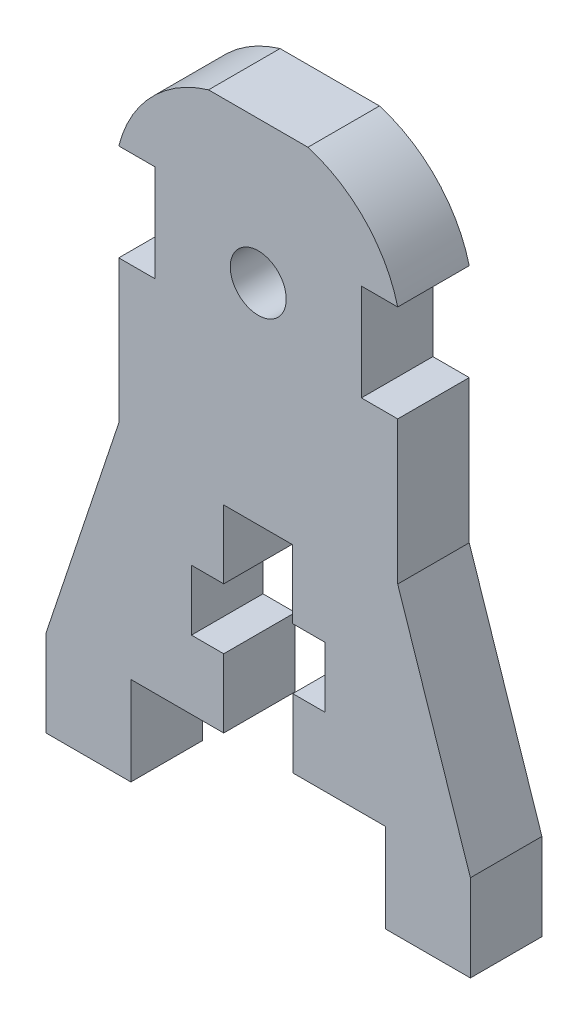
ISO-10303-21;
HEADER;
FILE_DESCRIPTION(('STEP AP214'),'2;1');
FILE_NAME('part.step','',(''),(''),'','','');
FILE_SCHEMA(('AUTOMOTIVE_DESIGN { 1 0 10303 214 1 1 1 1 }'));
ENDSEC;
DATA;
#1=APPLICATION_CONTEXT('core data for automotive mechanical design processes');
#2=APPLICATION_PROTOCOL_DEFINITION('international standard','automotive_design',2000,#1);
#3=PRODUCT_CONTEXT('',#1,'mechanical');
#4=PRODUCT('Part','Part','',(#3));
#5=PRODUCT_RELATED_PRODUCT_CATEGORY('part','',(#4));
#6=PRODUCT_DEFINITION_FORMATION('','',#4);
#7=PRODUCT_DEFINITION_CONTEXT('part definition',#1,'design');
#8=PRODUCT_DEFINITION('design','',#6,#7);
#9=PRODUCT_DEFINITION_SHAPE('','',#8);
#10=(LENGTH_UNIT() NAMED_UNIT(*) SI_UNIT(.MILLI.,.METRE.));
#11=(NAMED_UNIT(*) PLANE_ANGLE_UNIT() SI_UNIT($,.RADIAN.));
#12=(NAMED_UNIT(*) SI_UNIT($,.STERADIAN.) SOLID_ANGLE_UNIT());
#13=UNCERTAINTY_MEASURE_WITH_UNIT(LENGTH_MEASURE(1.E-05),#10,'distance_accuracy_value','');
#14=(GEOMETRIC_REPRESENTATION_CONTEXT(3) GLOBAL_UNCERTAINTY_ASSIGNED_CONTEXT((#13)) GLOBAL_UNIT_ASSIGNED_CONTEXT((#10,
#11,#12)) REPRESENTATION_CONTEXT('',''));
#15=CARTESIAN_POINT('',(0.,0.,0.));
#16=DIRECTION('',(0.,0.,1.));
#17=DIRECTION('',(1.,0.,0.));
#18=AXIS2_PLACEMENT_3D('',#15,#16,#17);
#19=CARTESIAN_POINT('',(-30.5254113425763,35.8164774723111,5.));
#20=DIRECTION('',(0.,0.,-1.));
#21=DIRECTION('',(-1.,0.,0.));
#22=AXIS2_PLACEMENT_3D('',#19,#20,#21);
#23=CYLINDRICAL_SURFACE('',#22,9.18388534174271);
#24=CARTESIAN_POINT('',(-30.5254113425763,35.8164774723111,0.));
#25=DIRECTION('',(0.,0.,1.));
#26=DIRECTION('',(1.,0.,0.));
#27=AXIS2_PLACEMENT_3D('',#24,#25,#26);
#28=CIRCLE('',#27,9.18388534174271);
#29=CARTESIAN_POINT('',(-27.900095449934,44.6171289501345,0.));
#30=VERTEX_POINT('',#29);
#31=CARTESIAN_POINT('',(-21.6253463064762,38.082,0.));
#32=VERTEX_POINT('',#31);
#33=EDGE_CURVE('E276',#30,#32,#28,.F.);
#34=ORIENTED_EDGE('',*,*,#33,.F.);
#35=DIRECTION('',(0.,0.,-1.));
#36=VECTOR('',#35,1.);
#37=CARTESIAN_POINT('',(-27.900095449934,44.6171289501345,5.));
#38=LINE('',#37,#36);
#39=CARTESIAN_POINT('',(-27.900095449934,44.6171289501345,5.));
#40=VERTEX_POINT('',#39);
#41=EDGE_CURVE('E11',#40,#30,#38,.T.);
#42=ORIENTED_EDGE('',*,*,#41,.F.);
#43=CARTESIAN_POINT('',(-30.5254113425763,35.8164774723111,5.));
#44=DIRECTION('',(0.,0.,1.));
#45=DIRECTION('',(1.,0.,0.));
#46=AXIS2_PLACEMENT_3D('',#43,#44,#45);
#47=CIRCLE('',#46,9.18388534174271);
#48=CARTESIAN_POINT('',(-21.6253463064762,38.082,5.));
#49=VERTEX_POINT('',#48);
#50=EDGE_CURVE('E358',#40,#49,#47,.F.);
#51=ORIENTED_EDGE('',*,*,#50,.T.);
#52=DIRECTION('',(0.,0.,-1.));
#53=VECTOR('',#52,1.);
#54=CARTESIAN_POINT('',(-21.6253463064762,38.082,5.));
#55=LINE('',#54,#53);
#56=EDGE_CURVE('E158',#49,#32,#55,.T.);
#57=ORIENTED_EDGE('',*,*,#56,.T.);
#58=EDGE_LOOP('',(#34,#42,#51,#57));
#59=FACE_BOUND('',#58,.T.);
#60=ADVANCED_FACE('F35',(#59),#23,.T.);
#61=CARTESIAN_POINT('',(0.,44.6171289501345,5.));
#62=DIRECTION('',(0.,-1.,0.));
#63=DIRECTION('',(0.,0.,-1.));
#64=AXIS2_PLACEMENT_3D('',#61,#62,#63);
#65=PLANE('',#64);
#66=DIRECTION('',(-1.,0.,0.));
#67=VECTOR('',#66,1.);
#68=CARTESIAN_POINT('',(0.,44.6171289501345,0.));
#69=LINE('',#68,#67);
#70=CARTESIAN_POINT('',(-34.8505971630185,44.6171289501345,0.));
#71=VERTEX_POINT('',#70);
#72=EDGE_CURVE('E279',#30,#71,#69,.T.);
#73=ORIENTED_EDGE('',*,*,#72,.T.);
#74=DIRECTION('',(0.,0.,-1.));
#75=VECTOR('',#74,1.);
#76=CARTESIAN_POINT('',(-34.8505971630185,44.6171289501345,5.));
#77=LINE('',#76,#75);
#78=CARTESIAN_POINT('',(-34.8505971630185,44.6171289501345,5.));
#79=VERTEX_POINT('',#78);
#80=EDGE_CURVE('E43',#79,#71,#77,.T.);
#81=ORIENTED_EDGE('',*,*,#80,.F.);
#82=DIRECTION('',(-1.,0.,0.));
#83=VECTOR('',#82,1.);
#84=CARTESIAN_POINT('',(0.,44.6171289501345,5.));
#85=LINE('',#84,#83);
#86=EDGE_CURVE('E449',#40,#79,#85,.T.);
#87=ORIENTED_EDGE('',*,*,#86,.F.);
#88=ORIENTED_EDGE('',*,*,#41,.T.);
#89=EDGE_LOOP('',(#73,#81,#87,#88));
#90=FACE_BOUND('',#89,.T.);
#91=ADVANCED_FACE('F524',(#90),#65,.F.);
#92=CARTESIAN_POINT('',(-32.2252812703762,35.8164774723111,5.));
#93=DIRECTION('',(0.,0.,-1.));
#94=DIRECTION('',(-1.,0.,0.));
#95=AXIS2_PLACEMENT_3D('',#92,#93,#94);
#96=CYLINDRICAL_SURFACE('',#95,9.18388534174271);
#97=CARTESIAN_POINT('',(-32.2252812703762,35.8164774723111,0.));
#98=DIRECTION('',(0.,0.,1.));
#99=DIRECTION('',(1.,0.,0.));
#100=AXIS2_PLACEMENT_3D('',#97,#98,#99);
#101=CIRCLE('',#100,9.18388534174271);
#102=CARTESIAN_POINT('',(-41.1253463064763,38.082,0.));
#103=VERTEX_POINT('',#102);
#104=EDGE_CURVE('E281',#71,#103,#101,.T.);
#105=ORIENTED_EDGE('',*,*,#104,.T.);
#106=DIRECTION('',(0.,0.,-1.));
#107=VECTOR('',#106,1.);
#108=CARTESIAN_POINT('',(-41.1253463064763,38.082,5.));
#109=LINE('',#108,#107);
#110=CARTESIAN_POINT('',(-41.1253463064763,38.082,5.));
#111=VERTEX_POINT('',#110);
#112=EDGE_CURVE('E422',#111,#103,#109,.T.);
#113=ORIENTED_EDGE('',*,*,#112,.F.);
#114=CARTESIAN_POINT('',(-32.2252812703762,35.8164774723111,5.));
#115=DIRECTION('',(0.,0.,1.));
#116=DIRECTION('',(1.,0.,0.));
#117=AXIS2_PLACEMENT_3D('',#114,#115,#116);
#118=CIRCLE('',#117,9.18388534174271);
#119=EDGE_CURVE('E430',#79,#111,#118,.T.);
#120=ORIENTED_EDGE('',*,*,#119,.F.);
#121=ORIENTED_EDGE('',*,*,#80,.T.);
#122=EDGE_LOOP('',(#105,#113,#120,#121));
#123=FACE_BOUND('',#122,.T.);
#124=ADVANCED_FACE('F428',(#123),#96,.T.);
#125=CARTESIAN_POINT('',(0.,38.082,5.));
#126=DIRECTION('',(0.,-1.,0.));
#127=DIRECTION('',(0.,0.,-1.));
#128=AXIS2_PLACEMENT_3D('',#125,#126,#127);
#129=PLANE('',#128);
#130=DIRECTION('',(-1.,0.,0.));
#131=VECTOR('',#130,1.);
#132=CARTESIAN_POINT('',(0.,38.082,0.));
#133=LINE('',#132,#131);
#134=CARTESIAN_POINT('',(-38.5853463064764,38.082,0.));
#135=VERTEX_POINT('',#134);
#136=EDGE_CURVE('E284',#135,#103,#133,.T.);
#137=ORIENTED_EDGE('',*,*,#136,.F.);
#138=DIRECTION('',(0.,0.,-1.));
#139=VECTOR('',#138,1.);
#140=CARTESIAN_POINT('',(-38.5853463064764,38.082,5.));
#141=LINE('',#140,#139);
#142=CARTESIAN_POINT('',(-38.5853463064764,38.082,5.));
#143=VERTEX_POINT('',#142);
#144=EDGE_CURVE('E420',#143,#135,#141,.T.);
#145=ORIENTED_EDGE('',*,*,#144,.F.);
#146=DIRECTION('',(-1.,0.,0.));
#147=VECTOR('',#146,1.);
#148=CARTESIAN_POINT('',(0.,38.082,5.));
#149=LINE('',#148,#147);
#150=EDGE_CURVE('E442',#143,#111,#149,.T.);
#151=ORIENTED_EDGE('',*,*,#150,.T.);
#152=ORIENTED_EDGE('',*,*,#112,.T.);
#153=EDGE_LOOP('',(#137,#145,#151,#152));
#154=FACE_BOUND('',#153,.T.);
#155=ADVANCED_FACE('F439',(#154),#129,.T.);
#156=CARTESIAN_POINT('',(-38.5853463064764,0.,5.));
#157=DIRECTION('',(-1.,0.,0.));
#158=DIRECTION('',(0.,0.,1.));
#159=AXIS2_PLACEMENT_3D('',#156,#157,#158);
#160=PLANE('',#159);
#161=DIRECTION('',(0.,1.,0.));
#162=VECTOR('',#161,1.);
#163=CARTESIAN_POINT('',(-38.5853463064764,0.,0.));
#164=LINE('',#163,#162);
#165=CARTESIAN_POINT('',(-38.5853463064764,31.309,0.));
#166=VERTEX_POINT('',#165);
#167=EDGE_CURVE('E287',#166,#135,#164,.T.);
#168=ORIENTED_EDGE('',*,*,#167,.F.);
#169=DIRECTION('',(0.,0.,-1.));
#170=VECTOR('',#169,1.);
#171=CARTESIAN_POINT('',(-38.5853463064764,31.309,5.));
#172=LINE('',#171,#170);
#173=CARTESIAN_POINT('',(-38.5853463064764,31.309,5.));
#174=VERTEX_POINT('',#173);
#175=EDGE_CURVE('E418',#174,#166,#172,.T.);
#176=ORIENTED_EDGE('',*,*,#175,.F.);
#177=DIRECTION('',(0.,1.,0.));
#178=VECTOR('',#177,1.);
#179=CARTESIAN_POINT('',(-38.5853463064764,0.,5.));
#180=LINE('',#179,#178);
#181=EDGE_CURVE('E445',#174,#143,#180,.T.);
#182=ORIENTED_EDGE('',*,*,#181,.T.);
#183=ORIENTED_EDGE('',*,*,#144,.T.);
#184=EDGE_LOOP('',(#168,#176,#182,#183));
#185=FACE_BOUND('',#184,.T.);
#186=ADVANCED_FACE('F534',(#185),#160,.T.);
#187=CARTESIAN_POINT('',(0.,31.309,5.));
#188=DIRECTION('',(0.,1.,0.));
#189=DIRECTION('',(0.,0.,1.));
#190=AXIS2_PLACEMENT_3D('',#187,#188,#189);
#191=PLANE('',#190);
#192=DIRECTION('',(1.,0.,0.));
#193=VECTOR('',#192,1.);
#194=CARTESIAN_POINT('',(0.,31.309,0.));
#195=LINE('',#194,#193);
#196=CARTESIAN_POINT('',(-41.1253463064763,31.309,0.));
#197=VERTEX_POINT('',#196);
#198=EDGE_CURVE('E290',#197,#166,#195,.T.);
#199=ORIENTED_EDGE('',*,*,#198,.F.);
#200=DIRECTION('',(0.,0.,-1.));
#201=VECTOR('',#200,1.);
#202=CARTESIAN_POINT('',(-41.1253463064763,31.309,5.));
#203=LINE('',#202,#201);
#204=CARTESIAN_POINT('',(-41.1253463064763,31.309,5.));
#205=VERTEX_POINT('',#204);
#206=EDGE_CURVE('E416',#205,#197,#203,.T.);
#207=ORIENTED_EDGE('',*,*,#206,.F.);
#208=DIRECTION('',(1.,0.,0.));
#209=VECTOR('',#208,1.);
#210=CARTESIAN_POINT('',(0.,31.309,5.));
#211=LINE('',#210,#209);
#212=EDGE_CURVE('E447',#205,#174,#211,.T.);
#213=ORIENTED_EDGE('',*,*,#212,.T.);
#214=ORIENTED_EDGE('',*,*,#175,.T.);
#215=EDGE_LOOP('',(#199,#207,#213,#214));
#216=FACE_BOUND('',#215,.T.);
#217=ADVANCED_FACE('F537',(#216),#191,.T.);
#218=CARTESIAN_POINT('',(-41.1253463064763,0.,5.));
#219=DIRECTION('',(-1.,0.,0.));
#220=DIRECTION('',(0.,0.,1.));
#221=AXIS2_PLACEMENT_3D('',#218,#219,#220);
#222=PLANE('',#221);
#223=DIRECTION('',(0.,1.,0.));
#224=VECTOR('',#223,1.);
#225=CARTESIAN_POINT('',(-41.1253463064763,0.,0.));
#226=LINE('',#225,#224);
#227=CARTESIAN_POINT('',(-41.1253463064763,21.309,0.));
#228=VERTEX_POINT('',#227);
#229=EDGE_CURVE('E293',#228,#197,#226,.T.);
#230=ORIENTED_EDGE('',*,*,#229,.F.);
#231=DIRECTION('',(0.,0.,-1.));
#232=VECTOR('',#231,1.);
#233=CARTESIAN_POINT('',(-41.1253463064763,21.309,5.));
#234=LINE('',#233,#232);
#235=CARTESIAN_POINT('',(-41.1253463064763,21.309,5.));
#236=VERTEX_POINT('',#235);
#237=EDGE_CURVE('E414',#236,#228,#234,.T.);
#238=ORIENTED_EDGE('',*,*,#237,.F.);
#239=DIRECTION('',(0.,1.,0.));
#240=VECTOR('',#239,1.);
#241=CARTESIAN_POINT('',(-41.1253463064763,0.,5.));
#242=LINE('',#241,#240);
#243=EDGE_CURVE('E455',#236,#205,#242,.T.);
#244=ORIENTED_EDGE('',*,*,#243,.T.);
#245=ORIENTED_EDGE('',*,*,#206,.T.);
#246=EDGE_LOOP('',(#230,#238,#244,#245));
#247=FACE_BOUND('',#246,.T.);
#248=ADVANCED_FACE('F541',(#247),#222,.T.);
#249=CARTESIAN_POINT('',(-43.4055116758286,14.4685038919429,5.));
#250=DIRECTION('',(-0.948683298050514,0.316227766016838,0.));
#251=DIRECTION('',(-0.316227766016838,-0.948683298050514,0.));
#252=AXIS2_PLACEMENT_3D('',#249,#250,#251);
#253=PLANE('',#252);
#254=DIRECTION('',(0.316227766016838,0.948683298050514,0.));
#255=VECTOR('',#254,1.);
#256=CARTESIAN_POINT('',(-43.4055116758286,14.4685038919429,0.));
#257=LINE('',#256,#255);
#258=CARTESIAN_POINT('',(-46.2053463064763,6.06899999999999,0.));
#259=VERTEX_POINT('',#258);
#260=EDGE_CURVE('E296',#259,#228,#257,.T.);
#261=ORIENTED_EDGE('',*,*,#260,.F.);
#262=DIRECTION('',(0.,0.,-1.));
#263=VECTOR('',#262,1.);
#264=CARTESIAN_POINT('',(-46.2053463064763,6.06899999999999,5.));
#265=LINE('',#264,#263);
#266=CARTESIAN_POINT('',(-46.2053463064763,6.06899999999999,5.));
#267=VERTEX_POINT('',#266);
#268=EDGE_CURVE('E412',#267,#259,#265,.T.);
#269=ORIENTED_EDGE('',*,*,#268,.F.);
#270=DIRECTION('',(0.316227766016838,0.948683298050514,0.));
#271=VECTOR('',#270,1.);
#272=CARTESIAN_POINT('',(-43.4055116758286,14.4685038919429,5.));
#273=LINE('',#272,#271);
#274=EDGE_CURVE('E458',#267,#236,#273,.T.);
#275=ORIENTED_EDGE('',*,*,#274,.T.);
#276=ORIENTED_EDGE('',*,*,#237,.T.);
#277=EDGE_LOOP('',(#261,#269,#275,#276));
#278=FACE_BOUND('',#277,.T.);
#279=ADVANCED_FACE('F545',(#278),#253,.T.);
#280=CARTESIAN_POINT('',(-46.2053463064763,0.,5.));
#281=DIRECTION('',(-1.,0.,0.));
#282=DIRECTION('',(0.,-1.,0.));
#283=AXIS2_PLACEMENT_3D('',#280,#281,#282);
#284=PLANE('',#283);
#285=DIRECTION('',(0.,1.,0.));
#286=VECTOR('',#285,1.);
#287=CARTESIAN_POINT('',(-46.2053463064763,0.,0.));
#288=LINE('',#287,#286);
#289=CARTESIAN_POINT('',(-46.2053463064763,0.,0.));
#290=VERTEX_POINT('',#289);
#291=EDGE_CURVE('E299',#290,#259,#288,.T.);
#292=ORIENTED_EDGE('',*,*,#291,.F.);
#293=DIRECTION('',(0.,0.,-1.));
#294=VECTOR('',#293,1.);
#295=CARTESIAN_POINT('',(-46.2053463064763,0.,5.));
#296=LINE('',#295,#294);
#297=CARTESIAN_POINT('',(-46.2053463064763,0.,5.));
#298=VERTEX_POINT('',#297);
#299=EDGE_CURVE('E410',#298,#290,#296,.T.);
#300=ORIENTED_EDGE('',*,*,#299,.F.);
#301=DIRECTION('',(0.,1.,0.));
#302=VECTOR('',#301,1.);
#303=CARTESIAN_POINT('',(-46.2053463064763,0.,5.));
#304=LINE('',#303,#302);
#305=EDGE_CURVE('E461',#298,#267,#304,.T.);
#306=ORIENTED_EDGE('',*,*,#305,.T.);
#307=ORIENTED_EDGE('',*,*,#268,.T.);
#308=EDGE_LOOP('',(#292,#300,#306,#307));
#309=FACE_BOUND('',#308,.T.);
#310=ADVANCED_FACE('F549',(#309),#284,.T.);
#311=CARTESIAN_POINT('',(0.,0.,5.));
#312=DIRECTION('',(0.,1.,0.));
#313=DIRECTION('',(-1.,0.,0.));
#314=AXIS2_PLACEMENT_3D('',#311,#312,#313);
#315=PLANE('',#314);
#316=DIRECTION('',(1.,0.,0.));
#317=VECTOR('',#316,1.);
#318=CARTESIAN_POINT('',(0.,0.,0.));
#319=LINE('',#318,#317);
#320=CARTESIAN_POINT('',(-40.2783463064762,0.,0.));
#321=VERTEX_POINT('',#320);
#322=EDGE_CURVE('E302',#290,#321,#319,.T.);
#323=ORIENTED_EDGE('',*,*,#322,.T.);
#324=DIRECTION('',(0.,0.,-1.));
#325=VECTOR('',#324,1.);
#326=CARTESIAN_POINT('',(-40.2783463064762,0.,5.));
#327=LINE('',#326,#325);
#328=CARTESIAN_POINT('',(-40.2783463064762,0.,5.));
#329=VERTEX_POINT('',#328);
#330=EDGE_CURVE('E407',#329,#321,#327,.T.);
#331=ORIENTED_EDGE('',*,*,#330,.F.);
#332=DIRECTION('',(1.,0.,0.));
#333=VECTOR('',#332,1.);
#334=CARTESIAN_POINT('',(0.,0.,5.));
#335=LINE('',#334,#333);
#336=EDGE_CURVE('E464',#298,#329,#335,.T.);
#337=ORIENTED_EDGE('',*,*,#336,.F.);
#338=ORIENTED_EDGE('',*,*,#299,.T.);
#339=EDGE_LOOP('',(#323,#331,#337,#338));
#340=FACE_BOUND('',#339,.T.);
#341=ADVANCED_FACE('F553',(#340),#315,.F.);
#342=CARTESIAN_POINT('',(-40.2783463064762,0.,5.));
#343=DIRECTION('',(-1.,0.,0.));
#344=DIRECTION('',(0.,0.,1.));
#345=AXIS2_PLACEMENT_3D('',#342,#343,#344);
#346=PLANE('',#345);
#347=DIRECTION('',(0.,1.,0.));
#348=VECTOR('',#347,1.);
#349=CARTESIAN_POINT('',(-40.2783463064762,0.,0.));
#350=LINE('',#349,#348);
#351=CARTESIAN_POINT('',(-40.2783463064762,6.20899999999999,0.));
#352=VERTEX_POINT('',#351);
#353=EDGE_CURVE('E304',#321,#352,#350,.T.);
#354=ORIENTED_EDGE('',*,*,#353,.T.);
#355=DIRECTION('',(0.,0.,-1.));
#356=VECTOR('',#355,1.);
#357=CARTESIAN_POINT('',(-40.2783463064762,6.20899999999999,5.));
#358=LINE('',#357,#356);
#359=CARTESIAN_POINT('',(-40.2783463064762,6.20899999999999,5.));
#360=VERTEX_POINT('',#359);
#361=EDGE_CURVE('E404',#360,#352,#358,.T.);
#362=ORIENTED_EDGE('',*,*,#361,.F.);
#363=DIRECTION('',(0.,1.,0.));
#364=VECTOR('',#363,1.);
#365=CARTESIAN_POINT('',(-40.2783463064762,0.,5.));
#366=LINE('',#365,#364);
#367=EDGE_CURVE('E466',#329,#360,#366,.T.);
#368=ORIENTED_EDGE('',*,*,#367,.F.);
#369=ORIENTED_EDGE('',*,*,#330,.T.);
#370=EDGE_LOOP('',(#354,#362,#368,#369));
#371=FACE_BOUND('',#370,.T.);
#372=ADVANCED_FACE('F557',(#371),#346,.F.);
#373=CARTESIAN_POINT('',(0.,6.20899999999999,5.));
#374=DIRECTION('',(0.,1.,0.));
#375=DIRECTION('',(-1.,0.,0.));
#376=AXIS2_PLACEMENT_3D('',#373,#374,#375);
#377=PLANE('',#376);
#378=DIRECTION('',(1.,0.,0.));
#379=VECTOR('',#378,1.);
#380=CARTESIAN_POINT('',(0.,6.20899999999999,0.));
#381=LINE('',#380,#379);
#382=CARTESIAN_POINT('',(-33.7883463064763,6.20899999999999,0.));
#383=VERTEX_POINT('',#382);
#384=EDGE_CURVE('E306',#352,#383,#381,.T.);
#385=ORIENTED_EDGE('',*,*,#384,.T.);
#386=DIRECTION('',(0.,0.,-1.));
#387=VECTOR('',#386,1.);
#388=CARTESIAN_POINT('',(-33.7883463064763,6.20899999999999,5.));
#389=LINE('',#388,#387);
#390=CARTESIAN_POINT('',(-33.7883463064763,6.20899999999999,5.));
#391=VERTEX_POINT('',#390);
#392=EDGE_CURVE('E401',#391,#383,#389,.T.);
#393=ORIENTED_EDGE('',*,*,#392,.F.);
#394=DIRECTION('',(1.,0.,0.));
#395=VECTOR('',#394,1.);
#396=CARTESIAN_POINT('',(0.,6.20899999999999,5.));
#397=LINE('',#396,#395);
#398=EDGE_CURVE('E468',#360,#391,#397,.T.);
#399=ORIENTED_EDGE('',*,*,#398,.F.);
#400=ORIENTED_EDGE('',*,*,#361,.T.);
#401=EDGE_LOOP('',(#385,#393,#399,#400));
#402=FACE_BOUND('',#401,.T.);
#403=ADVANCED_FACE('F561',(#402),#377,.F.);
#404=CARTESIAN_POINT('',(-33.7883463064763,0.,5.));
#405=DIRECTION('',(-1.,0.,0.));
#406=DIRECTION('',(0.,0.,1.));
#407=AXIS2_PLACEMENT_3D('',#404,#405,#406);
#408=PLANE('',#407);
#409=DIRECTION('',(0.,1.,0.));
#410=VECTOR('',#409,1.);
#411=CARTESIAN_POINT('',(-33.7883463064763,0.,0.));
#412=LINE('',#411,#410);
#413=CARTESIAN_POINT('',(-33.7883463064763,11.0080000000001,0.));
#414=VERTEX_POINT('',#413);
#415=EDGE_CURVE('E308',#383,#414,#412,.T.);
#416=ORIENTED_EDGE('',*,*,#415,.T.);
#417=DIRECTION('',(0.,0.,-1.));
#418=VECTOR('',#417,1.);
#419=CARTESIAN_POINT('',(-33.7883463064763,11.0080000000001,5.));
#420=LINE('',#419,#418);
#421=CARTESIAN_POINT('',(-33.7883463064763,11.0080000000001,5.));
#422=VERTEX_POINT('',#421);
#423=EDGE_CURVE('E398',#422,#414,#420,.T.);
#424=ORIENTED_EDGE('',*,*,#423,.F.);
#425=DIRECTION('',(0.,1.,0.));
#426=VECTOR('',#425,1.);
#427=CARTESIAN_POINT('',(-33.7883463064763,0.,5.));
#428=LINE('',#427,#426);
#429=EDGE_CURVE('E470',#391,#422,#428,.T.);
#430=ORIENTED_EDGE('',*,*,#429,.F.);
#431=ORIENTED_EDGE('',*,*,#392,.T.);
#432=EDGE_LOOP('',(#416,#424,#430,#431));
#433=FACE_BOUND('',#432,.T.);
#434=ADVANCED_FACE('F565',(#433),#408,.F.);
#435=CARTESIAN_POINT('',(0.,11.0080000000001,5.));
#436=DIRECTION('',(0.,-1.,0.));
#437=DIRECTION('',(0.,0.,-1.));
#438=AXIS2_PLACEMENT_3D('',#435,#436,#437);
#439=PLANE('',#438);
#440=DIRECTION('',(-1.,0.,0.));
#441=VECTOR('',#440,1.);
#442=CARTESIAN_POINT('',(0.,11.0080000000001,0.));
#443=LINE('',#442,#441);
#444=CARTESIAN_POINT('',(-36.0453463064763,11.0080000000001,0.));
#445=VERTEX_POINT('',#444);
#446=EDGE_CURVE('E310',#414,#445,#443,.T.);
#447=ORIENTED_EDGE('',*,*,#446,.T.);
#448=DIRECTION('',(0.,0.,-1.));
#449=VECTOR('',#448,1.);
#450=CARTESIAN_POINT('',(-36.0453463064763,11.0080000000001,5.));
#451=LINE('',#450,#449);
#452=CARTESIAN_POINT('',(-36.0453463064763,11.0080000000001,5.));
#453=VERTEX_POINT('',#452);
#454=EDGE_CURVE('E395',#453,#445,#451,.T.);
#455=ORIENTED_EDGE('',*,*,#454,.F.);
#456=DIRECTION('',(-1.,0.,0.));
#457=VECTOR('',#456,1.);
#458=CARTESIAN_POINT('',(0.,11.0080000000001,5.));
#459=LINE('',#458,#457);
#460=EDGE_CURVE('E472',#422,#453,#459,.T.);
#461=ORIENTED_EDGE('',*,*,#460,.F.);
#462=ORIENTED_EDGE('',*,*,#423,.T.);
#463=EDGE_LOOP('',(#447,#455,#461,#462));
#464=FACE_BOUND('',#463,.T.);
#465=ADVANCED_FACE('F569',(#464),#439,.F.);
#466=CARTESIAN_POINT('',(-36.0453463064763,0.,5.));
#467=DIRECTION('',(-1.,0.,0.));
#468=DIRECTION('',(0.,0.,1.));
#469=AXIS2_PLACEMENT_3D('',#466,#467,#468);
#470=PLANE('',#469);
#471=DIRECTION('',(0.,1.,0.));
#472=VECTOR('',#471,1.);
#473=CARTESIAN_POINT('',(-36.0453463064763,0.,0.));
#474=LINE('',#473,#472);
#475=CARTESIAN_POINT('',(-36.0453463064763,15.241,0.));
#476=VERTEX_POINT('',#475);
#477=EDGE_CURVE('E312',#445,#476,#474,.T.);
#478=ORIENTED_EDGE('',*,*,#477,.T.);
#479=DIRECTION('',(0.,0.,-1.));
#480=VECTOR('',#479,1.);
#481=CARTESIAN_POINT('',(-36.0453463064763,15.241,5.));
#482=LINE('',#481,#480);
#483=CARTESIAN_POINT('',(-36.0453463064763,15.241,5.));
#484=VERTEX_POINT('',#483);
#485=EDGE_CURVE('E392',#484,#476,#482,.T.);
#486=ORIENTED_EDGE('',*,*,#485,.F.);
#487=DIRECTION('',(0.,1.,0.));
#488=VECTOR('',#487,1.);
#489=CARTESIAN_POINT('',(-36.0453463064763,0.,5.));
#490=LINE('',#489,#488);
#491=EDGE_CURVE('E474',#453,#484,#490,.T.);
#492=ORIENTED_EDGE('',*,*,#491,.F.);
#493=ORIENTED_EDGE('',*,*,#454,.T.);
#494=EDGE_LOOP('',(#478,#486,#492,#493));
#495=FACE_BOUND('',#494,.T.);
#496=ADVANCED_FACE('F573',(#495),#470,.F.);
#497=CARTESIAN_POINT('',(0.,15.241,5.));
#498=DIRECTION('',(0.,1.,0.));
#499=DIRECTION('',(0.,0.,1.));
#500=AXIS2_PLACEMENT_3D('',#497,#498,#499);
#501=PLANE('',#500);
#502=DIRECTION('',(1.,0.,0.));
#503=VECTOR('',#502,1.);
#504=CARTESIAN_POINT('',(0.,15.241,0.));
#505=LINE('',#504,#503);
#506=CARTESIAN_POINT('',(-33.7873463064763,15.241,0.));
#507=VERTEX_POINT('',#506);
#508=EDGE_CURVE('E314',#476,#507,#505,.T.);
#509=ORIENTED_EDGE('',*,*,#508,.T.);
#510=DIRECTION('',(0.,0.,-1.));
#511=VECTOR('',#510,1.);
#512=CARTESIAN_POINT('',(-33.7873463064763,15.241,5.));
#513=LINE('',#512,#511);
#514=CARTESIAN_POINT('',(-33.7873463064763,15.241,5.));
#515=VERTEX_POINT('',#514);
#516=EDGE_CURVE('E389',#515,#507,#513,.T.);
#517=ORIENTED_EDGE('',*,*,#516,.F.);
#518=DIRECTION('',(1.,0.,0.));
#519=VECTOR('',#518,1.);
#520=CARTESIAN_POINT('',(0.,15.241,5.));
#521=LINE('',#520,#519);
#522=EDGE_CURVE('E476',#484,#515,#521,.T.);
#523=ORIENTED_EDGE('',*,*,#522,.F.);
#524=ORIENTED_EDGE('',*,*,#485,.T.);
#525=EDGE_LOOP('',(#509,#517,#523,#524));
#526=FACE_BOUND('',#525,.T.);
#527=ADVANCED_FACE('F577',(#526),#501,.F.);
#528=CARTESIAN_POINT('',(-33.7873463064763,0.,5.));
#529=DIRECTION('',(-1.,0.,0.));
#530=DIRECTION('',(0.,0.,1.));
#531=AXIS2_PLACEMENT_3D('',#528,#529,#530);
#532=PLANE('',#531);
#533=DIRECTION('',(0.,1.,0.));
#534=VECTOR('',#533,1.);
#535=CARTESIAN_POINT('',(-33.7873463064763,0.,0.));
#536=LINE('',#535,#534);
#537=CARTESIAN_POINT('',(-33.7873463064763,20.0189654008327,0.));
#538=VERTEX_POINT('',#537);
#539=EDGE_CURVE('E316',#507,#538,#536,.T.);
#540=ORIENTED_EDGE('',*,*,#539,.T.);
#541=DIRECTION('',(0.,0.,-1.));
#542=VECTOR('',#541,1.);
#543=CARTESIAN_POINT('',(-33.7873463064763,20.0189654008327,5.));
#544=LINE('',#543,#542);
#545=CARTESIAN_POINT('',(-33.7873463064763,20.0189654008327,5.));
#546=VERTEX_POINT('',#545);
#547=EDGE_CURVE('E386',#546,#538,#544,.T.);
#548=ORIENTED_EDGE('',*,*,#547,.F.);
#549=DIRECTION('',(0.,1.,0.));
#550=VECTOR('',#549,1.);
#551=CARTESIAN_POINT('',(-33.7873463064763,0.,5.));
#552=LINE('',#551,#550);
#553=EDGE_CURVE('E478',#515,#546,#552,.T.);
#554=ORIENTED_EDGE('',*,*,#553,.F.);
#555=ORIENTED_EDGE('',*,*,#516,.T.);
#556=EDGE_LOOP('',(#540,#548,#554,#555));
#557=FACE_BOUND('',#556,.T.);
#558=ADVANCED_FACE('F581',(#557),#532,.F.);
#559=CARTESIAN_POINT('',(0.,20.0189654008327,5.));
#560=DIRECTION('',(0.,1.,0.));
#561=DIRECTION('',(0.,0.,1.));
#562=AXIS2_PLACEMENT_3D('',#559,#560,#561);
#563=PLANE('',#562);
#564=DIRECTION('',(1.,0.,0.));
#565=VECTOR('',#564,1.);
#566=CARTESIAN_POINT('',(0.,20.0189654008327,0.));
#567=LINE('',#566,#565);
#568=CARTESIAN_POINT('',(-28.9633463064762,20.0189654008327,0.));
#569=VERTEX_POINT('',#568);
#570=EDGE_CURVE('E318',#538,#569,#567,.T.);
#571=ORIENTED_EDGE('',*,*,#570,.T.);
#572=DIRECTION('',(0.,0.,-1.));
#573=VECTOR('',#572,1.);
#574=CARTESIAN_POINT('',(-28.9633463064762,20.0189654008327,5.));
#575=LINE('',#574,#573);
#576=CARTESIAN_POINT('',(-28.9633463064762,20.0189654008327,5.));
#577=VERTEX_POINT('',#576);
#578=EDGE_CURVE('E384',#577,#569,#575,.T.);
#579=ORIENTED_EDGE('',*,*,#578,.F.);
#580=DIRECTION('',(1.,0.,0.));
#581=VECTOR('',#580,1.);
#582=CARTESIAN_POINT('',(0.,20.0189654008327,5.));
#583=LINE('',#582,#581);
#584=EDGE_CURVE('E480',#546,#577,#583,.T.);
#585=ORIENTED_EDGE('',*,*,#584,.F.);
#586=ORIENTED_EDGE('',*,*,#547,.T.);
#587=EDGE_LOOP('',(#571,#579,#585,#586));
#588=FACE_BOUND('',#587,.T.);
#589=ADVANCED_FACE('F585',(#588),#563,.F.);
#590=CARTESIAN_POINT('',(-28.9633463064762,0.,5.));
#591=DIRECTION('',(-1.,0.,0.));
#592=DIRECTION('',(0.,0.,1.));
#593=AXIS2_PLACEMENT_3D('',#590,#591,#592);
#594=PLANE('',#593);
#595=DIRECTION('',(0.,1.,0.));
#596=VECTOR('',#595,1.);
#597=CARTESIAN_POINT('',(-28.9633463064762,0.,0.));
#598=LINE('',#597,#596);
#599=CARTESIAN_POINT('',(-28.9633463064762,15.241,0.));
#600=VERTEX_POINT('',#599);
#601=EDGE_CURVE('E321',#600,#569,#598,.T.);
#602=ORIENTED_EDGE('',*,*,#601,.F.);
#603=DIRECTION('',(0.,0.,-1.));
#604=VECTOR('',#603,1.);
#605=CARTESIAN_POINT('',(-28.9633463064762,15.241,5.));
#606=LINE('',#605,#604);
#607=CARTESIAN_POINT('',(-28.9633463064762,15.241,5.));
#608=VERTEX_POINT('',#607);
#609=EDGE_CURVE('E382',#608,#600,#606,.T.);
#610=ORIENTED_EDGE('',*,*,#609,.F.);
#611=DIRECTION('',(0.,1.,0.));
#612=VECTOR('',#611,1.);
#613=CARTESIAN_POINT('',(-28.9633463064762,0.,5.));
#614=LINE('',#613,#612);
#615=EDGE_CURVE('E482',#608,#577,#614,.T.);
#616=ORIENTED_EDGE('',*,*,#615,.T.);
#617=ORIENTED_EDGE('',*,*,#578,.T.);
#618=EDGE_LOOP('',(#602,#610,#616,#617));
#619=FACE_BOUND('',#618,.T.);
#620=ADVANCED_FACE('F589',(#619),#594,.T.);
#621=CARTESIAN_POINT('',(0.,15.241,5.));
#622=DIRECTION('',(0.,-1.,0.));
#623=DIRECTION('',(0.,0.,-1.));
#624=AXIS2_PLACEMENT_3D('',#621,#622,#623);
#625=PLANE('',#624);
#626=DIRECTION('',(-1.,0.,0.));
#627=VECTOR('',#626,1.);
#628=CARTESIAN_POINT('',(0.,15.241,0.));
#629=LINE('',#628,#627);
#630=CARTESIAN_POINT('',(-26.7053463064762,15.241,0.));
#631=VERTEX_POINT('',#630);
#632=EDGE_CURVE('E324',#631,#600,#629,.T.);
#633=ORIENTED_EDGE('',*,*,#632,.F.);
#634=DIRECTION('',(0.,0.,-1.));
#635=VECTOR('',#634,1.);
#636=CARTESIAN_POINT('',(-26.7053463064762,15.241,5.));
#637=LINE('',#636,#635);
#638=CARTESIAN_POINT('',(-26.7053463064762,15.241,5.));
#639=VERTEX_POINT('',#638);
#640=EDGE_CURVE('E380',#639,#631,#637,.T.);
#641=ORIENTED_EDGE('',*,*,#640,.F.);
#642=DIRECTION('',(-1.,0.,0.));
#643=VECTOR('',#642,1.);
#644=CARTESIAN_POINT('',(0.,15.241,5.));
#645=LINE('',#644,#643);
#646=EDGE_CURVE('E485',#639,#608,#645,.T.);
#647=ORIENTED_EDGE('',*,*,#646,.T.);
#648=ORIENTED_EDGE('',*,*,#609,.T.);
#649=EDGE_LOOP('',(#633,#641,#647,#648));
#650=FACE_BOUND('',#649,.T.);
#651=ADVANCED_FACE('F593',(#650),#625,.T.);
#652=CARTESIAN_POINT('',(-26.7053463064762,0.,5.));
#653=DIRECTION('',(-1.,0.,0.));
#654=DIRECTION('',(0.,0.,1.));
#655=AXIS2_PLACEMENT_3D('',#652,#653,#654);
#656=PLANE('',#655);
#657=DIRECTION('',(0.,1.,0.));
#658=VECTOR('',#657,1.);
#659=CARTESIAN_POINT('',(-26.7053463064762,0.,0.));
#660=LINE('',#659,#658);
#661=CARTESIAN_POINT('',(-26.7053463064762,11.0080000000001,0.));
#662=VERTEX_POINT('',#661);
#663=EDGE_CURVE('E327',#662,#631,#660,.T.);
#664=ORIENTED_EDGE('',*,*,#663,.F.);
#665=DIRECTION('',(0.,0.,-1.));
#666=VECTOR('',#665,1.);
#667=CARTESIAN_POINT('',(-26.7053463064762,11.0080000000001,5.));
#668=LINE('',#667,#666);
#669=CARTESIAN_POINT('',(-26.7053463064762,11.0080000000001,5.));
#670=VERTEX_POINT('',#669);
#671=EDGE_CURVE('E378',#670,#662,#668,.T.);
#672=ORIENTED_EDGE('',*,*,#671,.F.);
#673=DIRECTION('',(0.,1.,0.));
#674=VECTOR('',#673,1.);
#675=CARTESIAN_POINT('',(-26.7053463064762,0.,5.));
#676=LINE('',#675,#674);
#677=EDGE_CURVE('E488',#670,#639,#676,.T.);
#678=ORIENTED_EDGE('',*,*,#677,.T.);
#679=ORIENTED_EDGE('',*,*,#640,.T.);
#680=EDGE_LOOP('',(#664,#672,#678,#679));
#681=FACE_BOUND('',#680,.T.);
#682=ADVANCED_FACE('F597',(#681),#656,.T.);
#683=CARTESIAN_POINT('',(0.,11.0080000000001,5.));
#684=DIRECTION('',(0.,1.,0.));
#685=DIRECTION('',(0.,0.,1.));
#686=AXIS2_PLACEMENT_3D('',#683,#684,#685);
#687=PLANE('',#686);
#688=DIRECTION('',(1.,0.,0.));
#689=VECTOR('',#688,1.);
#690=CARTESIAN_POINT('',(0.,11.0080000000001,0.));
#691=LINE('',#690,#689);
#692=CARTESIAN_POINT('',(-28.9623463064762,11.0080000000001,0.));
#693=VERTEX_POINT('',#692);
#694=EDGE_CURVE('E330',#693,#662,#691,.T.);
#695=ORIENTED_EDGE('',*,*,#694,.F.);
#696=DIRECTION('',(0.,0.,-1.));
#697=VECTOR('',#696,1.);
#698=CARTESIAN_POINT('',(-28.9623463064762,11.0080000000001,5.));
#699=LINE('',#698,#697);
#700=CARTESIAN_POINT('',(-28.9623463064762,11.0080000000001,5.));
#701=VERTEX_POINT('',#700);
#702=EDGE_CURVE('E376',#701,#693,#699,.T.);
#703=ORIENTED_EDGE('',*,*,#702,.F.);
#704=DIRECTION('',(1.,0.,0.));
#705=VECTOR('',#704,1.);
#706=CARTESIAN_POINT('',(0.,11.0080000000001,5.));
#707=LINE('',#706,#705);
#708=EDGE_CURVE('E491',#701,#670,#707,.T.);
#709=ORIENTED_EDGE('',*,*,#708,.T.);
#710=ORIENTED_EDGE('',*,*,#671,.T.);
#711=EDGE_LOOP('',(#695,#703,#709,#710));
#712=FACE_BOUND('',#711,.T.);
#713=ADVANCED_FACE('F601',(#712),#687,.T.);
#714=CARTESIAN_POINT('',(-28.9623463064762,0.,5.));
#715=DIRECTION('',(-1.,0.,0.));
#716=DIRECTION('',(0.,-1.,0.));
#717=AXIS2_PLACEMENT_3D('',#714,#715,#716);
#718=PLANE('',#717);
#719=DIRECTION('',(0.,1.,0.));
#720=VECTOR('',#719,1.);
#721=CARTESIAN_POINT('',(-28.9623463064762,0.,0.));
#722=LINE('',#721,#720);
#723=CARTESIAN_POINT('',(-28.9623463064762,6.20899999999999,0.));
#724=VERTEX_POINT('',#723);
#725=EDGE_CURVE('E333',#724,#693,#722,.T.);
#726=ORIENTED_EDGE('',*,*,#725,.F.);
#727=DIRECTION('',(0.,0.,-1.));
#728=VECTOR('',#727,1.);
#729=CARTESIAN_POINT('',(-28.9623463064762,6.20899999999999,5.));
#730=LINE('',#729,#728);
#731=CARTESIAN_POINT('',(-28.9623463064762,6.20899999999999,5.));
#732=VERTEX_POINT('',#731);
#733=EDGE_CURVE('E374',#732,#724,#730,.T.);
#734=ORIENTED_EDGE('',*,*,#733,.F.);
#735=DIRECTION('',(0.,1.,0.));
#736=VECTOR('',#735,1.);
#737=CARTESIAN_POINT('',(-28.9623463064762,0.,5.));
#738=LINE('',#737,#736);
#739=EDGE_CURVE('E494',#732,#701,#738,.T.);
#740=ORIENTED_EDGE('',*,*,#739,.T.);
#741=ORIENTED_EDGE('',*,*,#702,.T.);
#742=EDGE_LOOP('',(#726,#734,#740,#741));
#743=FACE_BOUND('',#742,.T.);
#744=ADVANCED_FACE('F605',(#743),#718,.T.);
#745=CARTESIAN_POINT('',(0.,6.20899999999998,5.));
#746=DIRECTION('',(0.,-1.,0.));
#747=DIRECTION('',(1.,0.,0.));
#748=AXIS2_PLACEMENT_3D('',#745,#746,#747);
#749=PLANE('',#748);
#750=DIRECTION('',(-1.,0.,0.));
#751=VECTOR('',#750,1.);
#752=CARTESIAN_POINT('',(0.,6.20899999999998,0.));
#753=LINE('',#752,#751);
#754=CARTESIAN_POINT('',(-22.4723463064763,6.20899999999999,0.));
#755=VERTEX_POINT('',#754);
#756=EDGE_CURVE('E336',#755,#724,#753,.T.);
#757=ORIENTED_EDGE('',*,*,#756,.F.);
#758=DIRECTION('',(0.,0.,-1.));
#759=VECTOR('',#758,1.);
#760=CARTESIAN_POINT('',(-22.4723463064763,6.20899999999999,5.));
#761=LINE('',#760,#759);
#762=CARTESIAN_POINT('',(-22.4723463064763,6.20899999999999,5.));
#763=VERTEX_POINT('',#762);
#764=EDGE_CURVE('E372',#763,#755,#761,.T.);
#765=ORIENTED_EDGE('',*,*,#764,.F.);
#766=DIRECTION('',(-1.,0.,0.));
#767=VECTOR('',#766,1.);
#768=CARTESIAN_POINT('',(0.,6.20899999999998,5.));
#769=LINE('',#768,#767);
#770=EDGE_CURVE('E497',#763,#732,#769,.T.);
#771=ORIENTED_EDGE('',*,*,#770,.T.);
#772=ORIENTED_EDGE('',*,*,#733,.T.);
#773=EDGE_LOOP('',(#757,#765,#771,#772));
#774=FACE_BOUND('',#773,.T.);
#775=ADVANCED_FACE('F609',(#774),#749,.T.);
#776=CARTESIAN_POINT('',(-22.4723463064763,0.,5.));
#777=DIRECTION('',(-1.,0.,0.));
#778=DIRECTION('',(0.,0.,1.));
#779=AXIS2_PLACEMENT_3D('',#776,#777,#778);
#780=PLANE('',#779);
#781=DIRECTION('',(0.,1.,0.));
#782=VECTOR('',#781,1.);
#783=CARTESIAN_POINT('',(-22.4723463064763,0.,0.));
#784=LINE('',#783,#782);
#785=CARTESIAN_POINT('',(-22.4723463064763,0.,0.));
#786=VERTEX_POINT('',#785);
#787=EDGE_CURVE('E339',#786,#755,#784,.T.);
#788=ORIENTED_EDGE('',*,*,#787,.F.);
#789=DIRECTION('',(0.,0.,-1.));
#790=VECTOR('',#789,1.);
#791=CARTESIAN_POINT('',(-22.4723463064763,0.,5.));
#792=LINE('',#791,#790);
#793=CARTESIAN_POINT('',(-22.4723463064763,0.,5.));
#794=VERTEX_POINT('',#793);
#795=EDGE_CURVE('E370',#794,#786,#792,.T.);
#796=ORIENTED_EDGE('',*,*,#795,.F.);
#797=DIRECTION('',(0.,1.,0.));
#798=VECTOR('',#797,1.);
#799=CARTESIAN_POINT('',(-22.4723463064763,0.,5.));
#800=LINE('',#799,#798);
#801=EDGE_CURVE('E500',#794,#763,#800,.T.);
#802=ORIENTED_EDGE('',*,*,#801,.T.);
#803=ORIENTED_EDGE('',*,*,#764,.T.);
#804=EDGE_LOOP('',(#788,#796,#802,#803));
#805=FACE_BOUND('',#804,.T.);
#806=ADVANCED_FACE('F613',(#805),#780,.T.);
#807=CARTESIAN_POINT('',(0.,0.,5.));
#808=DIRECTION('',(0.,-1.,0.));
#809=DIRECTION('',(1.,0.,0.));
#810=AXIS2_PLACEMENT_3D('',#807,#808,#809);
#811=PLANE('',#810);
#812=DIRECTION('',(-1.,0.,0.));
#813=VECTOR('',#812,1.);
#814=CARTESIAN_POINT('',(0.,0.,0.));
#815=LINE('',#814,#813);
#816=CARTESIAN_POINT('',(-16.5453463064762,0.,0.));
#817=VERTEX_POINT('',#816);
#818=EDGE_CURVE('E342',#817,#786,#815,.T.);
#819=ORIENTED_EDGE('',*,*,#818,.F.);
#820=DIRECTION('',(0.,0.,-1.));
#821=VECTOR('',#820,1.);
#822=CARTESIAN_POINT('',(-16.5453463064762,0.,5.));
#823=LINE('',#822,#821);
#824=CARTESIAN_POINT('',(-16.5453463064762,0.,5.));
#825=VERTEX_POINT('',#824);
#826=EDGE_CURVE('E368',#825,#817,#823,.T.);
#827=ORIENTED_EDGE('',*,*,#826,.F.);
#828=DIRECTION('',(-1.,0.,0.));
#829=VECTOR('',#828,1.);
#830=CARTESIAN_POINT('',(0.,0.,5.));
#831=LINE('',#830,#829);
#832=EDGE_CURVE('E503',#825,#794,#831,.T.);
#833=ORIENTED_EDGE('',*,*,#832,.T.);
#834=ORIENTED_EDGE('',*,*,#795,.T.);
#835=EDGE_LOOP('',(#819,#827,#833,#834));
#836=FACE_BOUND('',#835,.T.);
#837=ADVANCED_FACE('F617',(#836),#811,.T.);
#838=CARTESIAN_POINT('',(-16.5453463064762,0.,5.));
#839=DIRECTION('',(-1.,0.,0.));
#840=DIRECTION('',(0.,-1.,0.));
#841=AXIS2_PLACEMENT_3D('',#838,#839,#840);
#842=PLANE('',#841);
#843=DIRECTION('',(0.,1.,0.));
#844=VECTOR('',#843,1.);
#845=CARTESIAN_POINT('',(-16.5453463064762,0.,0.));
#846=LINE('',#845,#844);
#847=CARTESIAN_POINT('',(-16.5453463064762,6.06899999999999,0.));
#848=VERTEX_POINT('',#847);
#849=EDGE_CURVE('E345',#817,#848,#846,.T.);
#850=ORIENTED_EDGE('',*,*,#849,.T.);
#851=DIRECTION('',(0.,0.,-1.));
#852=VECTOR('',#851,1.);
#853=CARTESIAN_POINT('',(-16.5453463064762,6.06899999999999,5.));
#854=LINE('',#853,#852);
#855=CARTESIAN_POINT('',(-16.5453463064762,6.06899999999999,5.));
#856=VERTEX_POINT('',#855);
#857=EDGE_CURVE('E365',#856,#848,#854,.T.);
#858=ORIENTED_EDGE('',*,*,#857,.F.);
#859=DIRECTION('',(0.,1.,0.));
#860=VECTOR('',#859,1.);
#861=CARTESIAN_POINT('',(-16.5453463064762,0.,5.));
#862=LINE('',#861,#860);
#863=EDGE_CURVE('E506',#825,#856,#862,.T.);
#864=ORIENTED_EDGE('',*,*,#863,.F.);
#865=ORIENTED_EDGE('',*,*,#826,.T.);
#866=EDGE_LOOP('',(#850,#858,#864,#865));
#867=FACE_BOUND('',#866,.T.);
#868=ADVANCED_FACE('F621',(#867),#842,.F.);
#869=CARTESIAN_POINT('',(-13.0701116758286,-4.35670389194288,5.));
#870=DIRECTION('',(-0.948683298050514,-0.316227766016838,0.));
#871=DIRECTION('',(0.316227766016838,-0.948683298050514,0.));
#872=AXIS2_PLACEMENT_3D('',#869,#870,#871);
#873=PLANE('',#872);
#874=DIRECTION('',(-0.316227766016838,0.948683298050514,0.));
#875=VECTOR('',#874,1.);
#876=CARTESIAN_POINT('',(-13.0701116758286,-4.35670389194288,0.));
#877=LINE('',#876,#875);
#878=CARTESIAN_POINT('',(-21.6253463064762,21.309,0.));
#879=VERTEX_POINT('',#878);
#880=EDGE_CURVE('E347',#848,#879,#877,.T.);
#881=ORIENTED_EDGE('',*,*,#880,.T.);
#882=DIRECTION('',(0.,0.,-1.));
#883=VECTOR('',#882,1.);
#884=CARTESIAN_POINT('',(-21.6253463064762,21.309,5.));
#885=LINE('',#884,#883);
#886=CARTESIAN_POINT('',(-21.6253463064762,21.309,5.));
#887=VERTEX_POINT('',#886);
#888=EDGE_CURVE('E362',#887,#879,#885,.T.);
#889=ORIENTED_EDGE('',*,*,#888,.F.);
#890=DIRECTION('',(-0.316227766016838,0.948683298050514,0.));
#891=VECTOR('',#890,1.);
#892=CARTESIAN_POINT('',(-13.0701116758286,-4.35670389194288,5.));
#893=LINE('',#892,#891);
#894=EDGE_CURVE('E508',#856,#887,#893,.T.);
#895=ORIENTED_EDGE('',*,*,#894,.F.);
#896=ORIENTED_EDGE('',*,*,#857,.T.);
#897=EDGE_LOOP('',(#881,#889,#895,#896));
#898=FACE_BOUND('',#897,.T.);
#899=ADVANCED_FACE('F515',(#898),#873,.F.);
#900=CARTESIAN_POINT('',(-21.6253463064762,0.,5.));
#901=DIRECTION('',(-1.,0.,0.));
#902=DIRECTION('',(0.,-1.,0.));
#903=AXIS2_PLACEMENT_3D('',#900,#901,#902);
#904=PLANE('',#903);
#905=DIRECTION('',(0.,1.,0.));
#906=VECTOR('',#905,1.);
#907=CARTESIAN_POINT('',(-21.6253463064762,0.,0.));
#908=LINE('',#907,#906);
#909=CARTESIAN_POINT('',(-21.6253463064762,31.309,0.));
#910=VERTEX_POINT('',#909);
#911=EDGE_CURVE('E349',#879,#910,#908,.T.);
#912=ORIENTED_EDGE('',*,*,#911,.T.);
#913=DIRECTION('',(0.,0.,-1.));
#914=VECTOR('',#913,1.);
#915=CARTESIAN_POINT('',(-21.6253463064762,31.309,5.));
#916=LINE('',#915,#914);
#917=CARTESIAN_POINT('',(-21.6253463064762,31.309,5.));
#918=VERTEX_POINT('',#917);
#919=EDGE_CURVE('E265',#918,#910,#916,.T.);
#920=ORIENTED_EDGE('',*,*,#919,.F.);
#921=DIRECTION('',(0.,1.,0.));
#922=VECTOR('',#921,1.);
#923=CARTESIAN_POINT('',(-21.6253463064762,0.,5.));
#924=LINE('',#923,#922);
#925=EDGE_CURVE('E256',#887,#918,#924,.T.);
#926=ORIENTED_EDGE('',*,*,#925,.F.);
#927=ORIENTED_EDGE('',*,*,#888,.T.);
#928=EDGE_LOOP('',(#912,#920,#926,#927));
#929=FACE_BOUND('',#928,.T.);
#930=ADVANCED_FACE('F519',(#929),#904,.F.);
#931=CARTESIAN_POINT('',(0.,31.309,5.));
#932=DIRECTION('',(0.,-1.,0.));
#933=DIRECTION('',(0.,0.,-1.));
#934=AXIS2_PLACEMENT_3D('',#931,#932,#933);
#935=PLANE('',#934);
#936=DIRECTION('',(-1.,0.,0.));
#937=VECTOR('',#936,1.);
#938=CARTESIAN_POINT('',(0.,31.309,0.));
#939=LINE('',#938,#937);
#940=CARTESIAN_POINT('',(-24.1653463064761,31.309,0.));
#941=VERTEX_POINT('',#940);
#942=EDGE_CURVE('E264',#910,#941,#939,.T.);
#943=ORIENTED_EDGE('',*,*,#942,.T.);
#944=DIRECTION('',(0.,0.,-1.));
#945=VECTOR('',#944,1.);
#946=CARTESIAN_POINT('',(-24.1653463064761,31.309,5.));
#947=LINE('',#946,#945);
#948=CARTESIAN_POINT('',(-24.1653463064761,31.309,5.));
#949=VERTEX_POINT('',#948);
#950=EDGE_CURVE('E261',#949,#941,#947,.T.);
#951=ORIENTED_EDGE('',*,*,#950,.F.);
#952=DIRECTION('',(-1.,0.,0.));
#953=VECTOR('',#952,1.);
#954=CARTESIAN_POINT('',(0.,31.309,5.));
#955=LINE('',#954,#953);
#956=EDGE_CURVE('E249',#918,#949,#955,.T.);
#957=ORIENTED_EDGE('',*,*,#956,.F.);
#958=ORIENTED_EDGE('',*,*,#919,.T.);
#959=EDGE_LOOP('',(#943,#951,#957,#958));
#960=FACE_BOUND('',#959,.T.);
#961=ADVANCED_FACE('F262',(#960),#935,.F.);
#962=CARTESIAN_POINT('',(-24.1653463064761,0.,5.));
#963=DIRECTION('',(-1.,0.,0.));
#964=DIRECTION('',(0.,0.,1.));
#965=AXIS2_PLACEMENT_3D('',#962,#963,#964);
#966=PLANE('',#965);
#967=DIRECTION('',(0.,1.,0.));
#968=VECTOR('',#967,1.);
#969=CARTESIAN_POINT('',(-24.1653463064761,0.,0.));
#970=LINE('',#969,#968);
#971=CARTESIAN_POINT('',(-24.1653463064761,38.082,0.));
#972=VERTEX_POINT('',#971);
#973=EDGE_CURVE('E151',#941,#972,#970,.T.);
#974=ORIENTED_EDGE('',*,*,#973,.T.);
#975=DIRECTION('',(0.,0.,-1.));
#976=VECTOR('',#975,1.);
#977=CARTESIAN_POINT('',(-24.1653463064761,38.082,5.));
#978=LINE('',#977,#976);
#979=CARTESIAN_POINT('',(-24.1653463064761,38.082,5.));
#980=VERTEX_POINT('',#979);
#981=EDGE_CURVE('E266',#980,#972,#978,.T.);
#982=ORIENTED_EDGE('',*,*,#981,.F.);
#983=DIRECTION('',(0.,1.,0.));
#984=VECTOR('',#983,1.);
#985=CARTESIAN_POINT('',(-24.1653463064761,0.,5.));
#986=LINE('',#985,#984);
#987=EDGE_CURVE('E254',#949,#980,#986,.T.);
#988=ORIENTED_EDGE('',*,*,#987,.F.);
#989=ORIENTED_EDGE('',*,*,#950,.T.);
#990=EDGE_LOOP('',(#974,#982,#988,#989));
#991=FACE_BOUND('',#990,.T.);
#992=ADVANCED_FACE('F268',(#991),#966,.F.);
#993=CARTESIAN_POINT('',(0.,38.082,5.));
#994=DIRECTION('',(0.,1.,0.));
#995=DIRECTION('',(0.,0.,1.));
#996=AXIS2_PLACEMENT_3D('',#993,#994,#995);
#997=PLANE('',#996);
#998=DIRECTION('',(1.,0.,0.));
#999=VECTOR('',#998,1.);
#1000=CARTESIAN_POINT('',(0.,38.082,0.));
#1001=LINE('',#1000,#999);
#1002=EDGE_CURVE('E353',#972,#32,#1001,.T.);
#1003=ORIENTED_EDGE('',*,*,#1002,.T.);
#1004=ORIENTED_EDGE('',*,*,#56,.F.);
#1005=DIRECTION('',(1.,0.,0.));
#1006=VECTOR('',#1005,1.);
#1007=CARTESIAN_POINT('',(0.,38.082,5.));
#1008=LINE('',#1007,#1006);
#1009=EDGE_CURVE('E51',#980,#49,#1008,.T.);
#1010=ORIENTED_EDGE('',*,*,#1009,.F.);
#1011=ORIENTED_EDGE('',*,*,#981,.T.);
#1012=EDGE_LOOP('',(#1003,#1004,#1010,#1011));
#1013=FACE_BOUND('',#1012,.T.);
#1014=ADVANCED_FACE('F522',(#1013),#997,.F.);
#1015=CARTESIAN_POINT('',(-31.3753463064763,34.6589654008327,5.));
#1016=DIRECTION('',(0.,0.,-1.));
#1017=DIRECTION('',(-1.,0.,0.));
#1018=AXIS2_PLACEMENT_3D('',#1015,#1016,#1017);
#1019=CYLINDRICAL_SURFACE('',#1018,1.955);
#1020=CARTESIAN_POINT('',(-31.3753463064763,34.6589654008327,5.));
#1021=DIRECTION('',(0.,0.,1.));
#1022=DIRECTION('',(1.,0.,0.));
#1023=AXIS2_PLACEMENT_3D('',#1020,#1021,#1022);
#1024=CIRCLE('',#1023,1.955);
#1025=CARTESIAN_POINT('',(-29.4203463064763,34.6589654008327,5.));
#1026=VERTEX_POINT('',#1025);
#1027=EDGE_CURVE('E270',#1026,#1026,#1024,.T.);
#1028=ORIENTED_EDGE('',*,*,#1027,.T.);
#1029=EDGE_LOOP('',(#1028));
#1030=FACE_BOUND('',#1029,.T.);
#1031=CARTESIAN_POINT('',(-31.3753463064763,34.6589654008327,0.));
#1032=DIRECTION('',(0.,0.,1.));
#1033=DIRECTION('',(1.,0.,0.));
#1034=AXIS2_PLACEMENT_3D('',#1031,#1032,#1033);
#1035=CIRCLE('',#1034,1.955);
#1036=CARTESIAN_POINT('',(-29.4203463064763,34.6589654008327,0.));
#1037=VERTEX_POINT('',#1036);
#1038=EDGE_CURVE('E355',#1037,#1037,#1035,.T.);
#1039=ORIENTED_EDGE('',*,*,#1038,.F.);
#1040=EDGE_LOOP('',(#1039));
#1041=FACE_BOUND('',#1040,.T.);
#1042=ADVANCED_FACE('F636',(#1030,#1041),#1019,.F.);
#1043=CARTESIAN_POINT('',(0.,0.,5.));
#1044=DIRECTION('',(0.,0.,1.));
#1045=DIRECTION('',(1.,0.,0.));
#1046=AXIS2_PLACEMENT_3D('',#1043,#1044,#1045);
#1047=PLANE('',#1046);
#1048=ORIENTED_EDGE('',*,*,#50,.F.);
#1049=ORIENTED_EDGE('',*,*,#86,.T.);
#1050=ORIENTED_EDGE('',*,*,#119,.T.);
#1051=ORIENTED_EDGE('',*,*,#150,.F.);
#1052=ORIENTED_EDGE('',*,*,#181,.F.);
#1053=ORIENTED_EDGE('',*,*,#212,.F.);
#1054=ORIENTED_EDGE('',*,*,#243,.F.);
#1055=ORIENTED_EDGE('',*,*,#274,.F.);
#1056=ORIENTED_EDGE('',*,*,#305,.F.);
#1057=ORIENTED_EDGE('',*,*,#336,.T.);
#1058=ORIENTED_EDGE('',*,*,#367,.T.);
#1059=ORIENTED_EDGE('',*,*,#398,.T.);
#1060=ORIENTED_EDGE('',*,*,#429,.T.);
#1061=ORIENTED_EDGE('',*,*,#460,.T.);
#1062=ORIENTED_EDGE('',*,*,#491,.T.);
#1063=ORIENTED_EDGE('',*,*,#522,.T.);
#1064=ORIENTED_EDGE('',*,*,#553,.T.);
#1065=ORIENTED_EDGE('',*,*,#584,.T.);
#1066=ORIENTED_EDGE('',*,*,#615,.F.);
#1067=ORIENTED_EDGE('',*,*,#646,.F.);
#1068=ORIENTED_EDGE('',*,*,#677,.F.);
#1069=ORIENTED_EDGE('',*,*,#708,.F.);
#1070=ORIENTED_EDGE('',*,*,#739,.F.);
#1071=ORIENTED_EDGE('',*,*,#770,.F.);
#1072=ORIENTED_EDGE('',*,*,#801,.F.);
#1073=ORIENTED_EDGE('',*,*,#832,.F.);
#1074=ORIENTED_EDGE('',*,*,#863,.T.);
#1075=ORIENTED_EDGE('',*,*,#894,.T.);
#1076=ORIENTED_EDGE('',*,*,#925,.T.);
#1077=ORIENTED_EDGE('',*,*,#956,.T.);
#1078=ORIENTED_EDGE('',*,*,#987,.T.);
#1079=ORIENTED_EDGE('',*,*,#1009,.T.);
#1080=EDGE_LOOP('',(#1048,#1049,#1050,#1051,#1052,#1053,#1054,#1055,#1056,#1057,#1058,#1059,
#1060,#1061,#1062,#1063,#1064,#1065,#1066,#1067,#1068,#1069,#1070,#1071,#1072,#1073,#1074,#1075,
#1076,#1077,#1078,#1079));
#1081=FACE_BOUND('',#1080,.T.);
#1082=ORIENTED_EDGE('',*,*,#1027,.F.);
#1083=EDGE_LOOP('',(#1082));
#1084=FACE_BOUND('',#1083,.T.);
#1085=ADVANCED_FACE('F251',(#1081,#1084),#1047,.T.);
#1086=CARTESIAN_POINT('',(0.,0.,0.));
#1087=DIRECTION('',(0.,0.,1.));
#1088=DIRECTION('',(1.,0.,0.));
#1089=AXIS2_PLACEMENT_3D('',#1086,#1087,#1088);
#1090=PLANE('',#1089);
#1091=ORIENTED_EDGE('',*,*,#33,.T.);
#1092=ORIENTED_EDGE('',*,*,#1002,.F.);
#1093=ORIENTED_EDGE('',*,*,#973,.F.);
#1094=ORIENTED_EDGE('',*,*,#942,.F.);
#1095=ORIENTED_EDGE('',*,*,#911,.F.);
#1096=ORIENTED_EDGE('',*,*,#880,.F.);
#1097=ORIENTED_EDGE('',*,*,#849,.F.);
#1098=ORIENTED_EDGE('',*,*,#818,.T.);
#1099=ORIENTED_EDGE('',*,*,#787,.T.);
#1100=ORIENTED_EDGE('',*,*,#756,.T.);
#1101=ORIENTED_EDGE('',*,*,#725,.T.);
#1102=ORIENTED_EDGE('',*,*,#694,.T.);
#1103=ORIENTED_EDGE('',*,*,#663,.T.);
#1104=ORIENTED_EDGE('',*,*,#632,.T.);
#1105=ORIENTED_EDGE('',*,*,#601,.T.);
#1106=ORIENTED_EDGE('',*,*,#570,.F.);
#1107=ORIENTED_EDGE('',*,*,#539,.F.);
#1108=ORIENTED_EDGE('',*,*,#508,.F.);
#1109=ORIENTED_EDGE('',*,*,#477,.F.);
#1110=ORIENTED_EDGE('',*,*,#446,.F.);
#1111=ORIENTED_EDGE('',*,*,#415,.F.);
#1112=ORIENTED_EDGE('',*,*,#384,.F.);
#1113=ORIENTED_EDGE('',*,*,#353,.F.);
#1114=ORIENTED_EDGE('',*,*,#322,.F.);
#1115=ORIENTED_EDGE('',*,*,#291,.T.);
#1116=ORIENTED_EDGE('',*,*,#260,.T.);
#1117=ORIENTED_EDGE('',*,*,#229,.T.);
#1118=ORIENTED_EDGE('',*,*,#198,.T.);
#1119=ORIENTED_EDGE('',*,*,#167,.T.);
#1120=ORIENTED_EDGE('',*,*,#136,.T.);
#1121=ORIENTED_EDGE('',*,*,#104,.F.);
#1122=ORIENTED_EDGE('',*,*,#72,.F.);
#1123=EDGE_LOOP('',(#1091,#1092,#1093,#1094,#1095,#1096,#1097,#1098,#1099,#1100,#1101,#1102,
#1103,#1104,#1105,#1106,#1107,#1108,#1109,#1110,#1111,#1112,#1113,#1114,#1115,#1116,#1117,#1118,
#1119,#1120,#1121,#1122));
#1124=FACE_BOUND('',#1123,.T.);
#1125=ORIENTED_EDGE('',*,*,#1038,.T.);
#1126=EDGE_LOOP('',(#1125));
#1127=FACE_BOUND('',#1126,.T.);
#1128=ADVANCED_FACE('F434',(#1124,#1127),#1090,.F.);
#1129=CLOSED_SHELL('',(#60,#91,#124,#155,#186,#217,#248,#279,#310,#341,#372,#403,#434,#465,#496,
#527,#558,#589,#620,#651,#682,#713,#744,#775,#806,#837,#868,#899,#930,#961,#992,#1014,#1042,
#1085,#1128));
#1130=MANIFOLD_SOLID_BREP('B2',#1129);
#1131=ADVANCED_BREP_SHAPE_REPRESENTATION('',(#18,#1130),#14);
#1132=SHAPE_DEFINITION_REPRESENTATION(#9,#1131);
ENDSEC;
END-ISO-10303-21;
